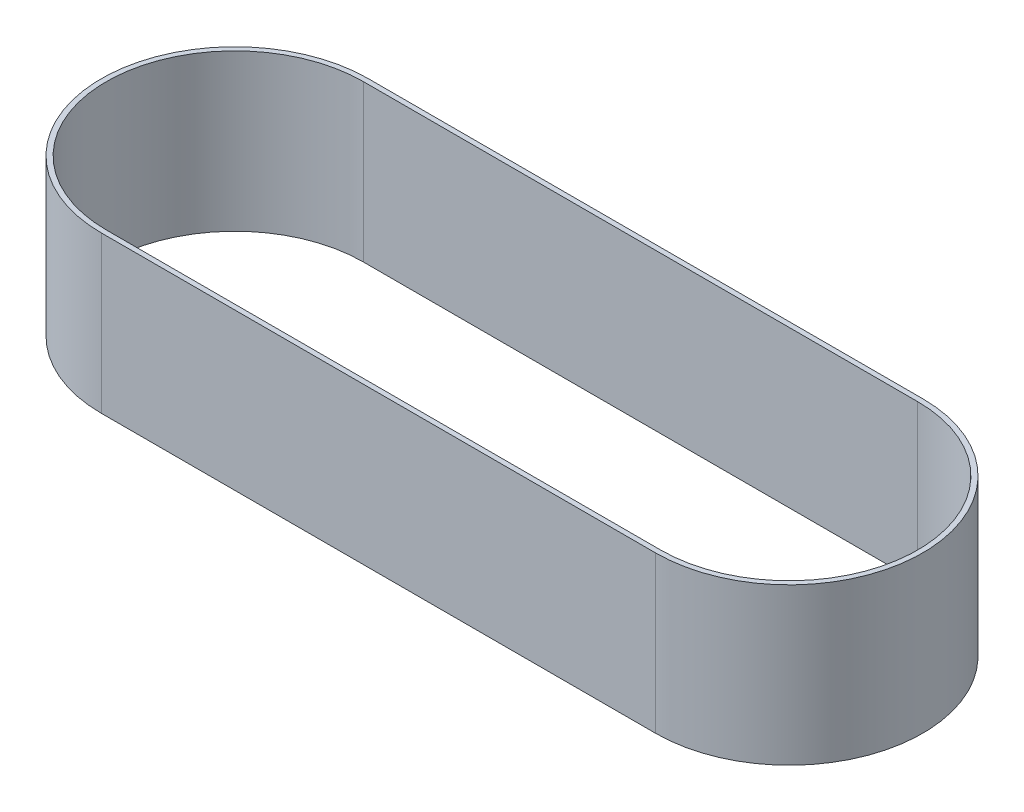
ISO-10303-21;
HEADER;
FILE_DESCRIPTION(('STEP AP214'),'2;1');
FILE_NAME('part.step','',(''),(''),'','','');
FILE_SCHEMA(('AUTOMOTIVE_DESIGN { 1 0 10303 214 1 1 1 1 }'));
ENDSEC;
DATA;
#1=APPLICATION_CONTEXT('core data for automotive mechanical design processes');
#2=APPLICATION_PROTOCOL_DEFINITION('international standard','automotive_design',2000,#1);
#3=PRODUCT_CONTEXT('',#1,'mechanical');
#4=PRODUCT('Part','Part','',(#3));
#5=PRODUCT_RELATED_PRODUCT_CATEGORY('part','',(#4));
#6=PRODUCT_DEFINITION_FORMATION('','',#4);
#7=PRODUCT_DEFINITION_CONTEXT('part definition',#1,'design');
#8=PRODUCT_DEFINITION('design','',#6,#7);
#9=PRODUCT_DEFINITION_SHAPE('','',#8);
#10=(LENGTH_UNIT() NAMED_UNIT(*) SI_UNIT(.MILLI.,.METRE.));
#11=(NAMED_UNIT(*) PLANE_ANGLE_UNIT() SI_UNIT($,.RADIAN.));
#12=(NAMED_UNIT(*) SI_UNIT($,.STERADIAN.) SOLID_ANGLE_UNIT());
#13=UNCERTAINTY_MEASURE_WITH_UNIT(LENGTH_MEASURE(1.E-05),#10,'distance_accuracy_value','');
#14=(GEOMETRIC_REPRESENTATION_CONTEXT(3) GLOBAL_UNCERTAINTY_ASSIGNED_CONTEXT((#13)) GLOBAL_UNIT_ASSIGNED_CONTEXT((#10,
#11,#12)) REPRESENTATION_CONTEXT('',''));
#15=CARTESIAN_POINT('',(0.,0.,0.));
#16=DIRECTION('',(0.,0.,1.));
#17=DIRECTION('',(1.,0.,0.));
#18=AXIS2_PLACEMENT_3D('',#15,#16,#17);
#19=CARTESIAN_POINT('',(0.,62.,53.));
#20=DIRECTION('',(0.,0.,-1.));
#21=DIRECTION('',(-1.,0.,0.));
#22=AXIS2_PLACEMENT_3D('',#19,#20,#21);
#23=PLANE('',#22);
#24=DIRECTION('',(1.,0.,0.));
#25=VECTOR('',#24,1.);
#26=CARTESIAN_POINT('',(0.,0.,53.));
#27=LINE('',#26,#25);
#28=CARTESIAN_POINT('',(-110.,0.,53.));
#29=VERTEX_POINT('',#28);
#30=CARTESIAN_POINT('',(110.,0.,53.));
#31=VERTEX_POINT('',#30);
#32=EDGE_CURVE('E141',#29,#31,#27,.T.);
#33=ORIENTED_EDGE('',*,*,#32,.T.);
#34=DIRECTION('',(0.,-1.,0.));
#35=VECTOR('',#34,1.);
#36=CARTESIAN_POINT('',(110.,62.,53.));
#37=LINE('',#36,#35);
#38=CARTESIAN_POINT('',(110.,62.,53.));
#39=VERTEX_POINT('',#38);
#40=EDGE_CURVE('E11',#39,#31,#37,.T.);
#41=ORIENTED_EDGE('',*,*,#40,.F.);
#42=DIRECTION('',(1.,0.,0.));
#43=VECTOR('',#42,1.);
#44=CARTESIAN_POINT('',(0.,62.,53.));
#45=LINE('',#44,#43);
#46=CARTESIAN_POINT('',(-110.,62.,53.));
#47=VERTEX_POINT('',#46);
#48=EDGE_CURVE('E112',#47,#39,#45,.T.);
#49=ORIENTED_EDGE('',*,*,#48,.F.);
#50=DIRECTION('',(0.,-1.,0.));
#51=VECTOR('',#50,1.);
#52=CARTESIAN_POINT('',(-110.,62.,53.));
#53=LINE('',#52,#51);
#54=EDGE_CURVE('E149',#47,#29,#53,.T.);
#55=ORIENTED_EDGE('',*,*,#54,.T.);
#56=EDGE_LOOP('',(#33,#41,#49,#55));
#57=FACE_BOUND('',#56,.T.);
#58=ADVANCED_FACE('F35',(#57),#23,.F.);
#59=CARTESIAN_POINT('',(110.,62.,0.));
#60=DIRECTION('',(0.,-1.,0.));
#61=DIRECTION('',(0.,0.,-1.));
#62=AXIS2_PLACEMENT_3D('',#59,#60,#61);
#63=CYLINDRICAL_SURFACE('',#62,53.);
#64=CARTESIAN_POINT('',(110.,0.,0.));
#65=DIRECTION('',(0.,1.,0.));
#66=DIRECTION('',(0.,0.,1.));
#67=AXIS2_PLACEMENT_3D('',#64,#65,#66);
#68=CIRCLE('',#67,53.);
#69=CARTESIAN_POINT('',(110.,0.,-53.));
#70=VERTEX_POINT('',#69);
#71=EDGE_CURVE('E118',#31,#70,#68,.T.);
#72=ORIENTED_EDGE('',*,*,#71,.T.);
#73=DIRECTION('',(0.,-1.,0.));
#74=VECTOR('',#73,1.);
#75=CARTESIAN_POINT('',(110.,62.,-53.));
#76=LINE('',#75,#74);
#77=CARTESIAN_POINT('',(110.,62.,-53.));
#78=VERTEX_POINT('',#77);
#79=EDGE_CURVE('E45',#78,#70,#76,.T.);
#80=ORIENTED_EDGE('',*,*,#79,.F.);
#81=CARTESIAN_POINT('',(110.,62.,0.));
#82=DIRECTION('',(0.,1.,0.));
#83=DIRECTION('',(0.,0.,1.));
#84=AXIS2_PLACEMENT_3D('',#81,#82,#83);
#85=CIRCLE('',#84,53.);
#86=EDGE_CURVE('E106',#39,#78,#85,.T.);
#87=ORIENTED_EDGE('',*,*,#86,.F.);
#88=ORIENTED_EDGE('',*,*,#40,.T.);
#89=EDGE_LOOP('',(#72,#80,#87,#88));
#90=FACE_BOUND('',#89,.T.);
#91=ADVANCED_FACE('F117',(#90),#63,.T.);
#92=CARTESIAN_POINT('',(0.,62.,-53.));
#93=DIRECTION('',(0.,0.,-1.));
#94=DIRECTION('',(-1.,0.,0.));
#95=AXIS2_PLACEMENT_3D('',#92,#93,#94);
#96=PLANE('',#95);
#97=DIRECTION('',(1.,0.,0.));
#98=VECTOR('',#97,1.);
#99=CARTESIAN_POINT('',(0.,0.,-53.));
#100=LINE('',#99,#98);
#101=CARTESIAN_POINT('',(-110.,0.,-53.));
#102=VERTEX_POINT('',#101);
#103=EDGE_CURVE('E145',#102,#70,#100,.T.);
#104=ORIENTED_EDGE('',*,*,#103,.F.);
#105=DIRECTION('',(0.,-1.,0.));
#106=VECTOR('',#105,1.);
#107=CARTESIAN_POINT('',(-110.,62.,-53.));
#108=LINE('',#107,#106);
#109=CARTESIAN_POINT('',(-110.,62.,-53.));
#110=VERTEX_POINT('',#109);
#111=EDGE_CURVE('E82',#110,#102,#108,.T.);
#112=ORIENTED_EDGE('',*,*,#111,.F.);
#113=DIRECTION('',(1.,0.,0.));
#114=VECTOR('',#113,1.);
#115=CARTESIAN_POINT('',(0.,62.,-53.));
#116=LINE('',#115,#114);
#117=EDGE_CURVE('E110',#110,#78,#116,.T.);
#118=ORIENTED_EDGE('',*,*,#117,.T.);
#119=ORIENTED_EDGE('',*,*,#79,.T.);
#120=EDGE_LOOP('',(#104,#112,#118,#119));
#121=FACE_BOUND('',#120,.T.);
#122=ADVANCED_FACE('F123',(#121),#96,.T.);
#123=CARTESIAN_POINT('',(-110.,62.,0.));
#124=DIRECTION('',(0.,-1.,0.));
#125=DIRECTION('',(0.,0.,-1.));
#126=AXIS2_PLACEMENT_3D('',#123,#124,#125);
#127=CYLINDRICAL_SURFACE('',#126,51.);
#128=CARTESIAN_POINT('',(-110.,0.,0.));
#129=DIRECTION('',(0.,1.,0.));
#130=DIRECTION('',(0.,0.,1.));
#131=AXIS2_PLACEMENT_3D('',#128,#129,#130);
#132=CIRCLE('',#131,51.);
#133=CARTESIAN_POINT('',(-110.,0.,-51.));
#134=VERTEX_POINT('',#133);
#135=CARTESIAN_POINT('',(-110.,0.,51.));
#136=VERTEX_POINT('',#135);
#137=EDGE_CURVE('E129',#134,#136,#132,.T.);
#138=ORIENTED_EDGE('',*,*,#137,.F.);
#139=DIRECTION('',(0.,-1.,0.));
#140=VECTOR('',#139,1.);
#141=CARTESIAN_POINT('',(-110.,62.,-51.));
#142=LINE('',#141,#140);
#143=CARTESIAN_POINT('',(-110.,62.,-51.));
#144=VERTEX_POINT('',#143);
#145=EDGE_CURVE('E39',#144,#134,#142,.T.);
#146=ORIENTED_EDGE('',*,*,#145,.F.);
#147=CARTESIAN_POINT('',(-110.,62.,0.));
#148=DIRECTION('',(0.,1.,0.));
#149=DIRECTION('',(0.,0.,1.));
#150=AXIS2_PLACEMENT_3D('',#147,#148,#149);
#151=CIRCLE('',#150,51.);
#152=CARTESIAN_POINT('',(-110.,62.,51.));
#153=VERTEX_POINT('',#152);
#154=EDGE_CURVE('E148',#144,#153,#151,.T.);
#155=ORIENTED_EDGE('',*,*,#154,.T.);
#156=DIRECTION('',(0.,-1.,0.));
#157=VECTOR('',#156,1.);
#158=CARTESIAN_POINT('',(-110.,62.,51.));
#159=LINE('',#158,#157);
#160=EDGE_CURVE('E125',#153,#136,#159,.T.);
#161=ORIENTED_EDGE('',*,*,#160,.T.);
#162=EDGE_LOOP('',(#138,#146,#155,#161));
#163=FACE_BOUND('',#162,.T.);
#164=ADVANCED_FACE('F37',(#163),#127,.F.);
#165=CARTESIAN_POINT('',(0.,62.,-51.));
#166=DIRECTION('',(0.,0.,-1.));
#167=DIRECTION('',(-1.,0.,0.));
#168=AXIS2_PLACEMENT_3D('',#165,#166,#167);
#169=PLANE('',#168);
#170=DIRECTION('',(1.,0.,0.));
#171=VECTOR('',#170,1.);
#172=CARTESIAN_POINT('',(0.,0.,-51.));
#173=LINE('',#172,#171);
#174=CARTESIAN_POINT('',(110.,0.,-51.));
#175=VERTEX_POINT('',#174);
#176=EDGE_CURVE('E132',#134,#175,#173,.T.);
#177=ORIENTED_EDGE('',*,*,#176,.T.);
#178=DIRECTION('',(0.,-1.,0.));
#179=VECTOR('',#178,1.);
#180=CARTESIAN_POINT('',(110.,62.,-51.));
#181=LINE('',#180,#179);
#182=CARTESIAN_POINT('',(110.,62.,-51.));
#183=VERTEX_POINT('',#182);
#184=EDGE_CURVE('E154',#183,#175,#181,.T.);
#185=ORIENTED_EDGE('',*,*,#184,.F.);
#186=DIRECTION('',(1.,0.,0.));
#187=VECTOR('',#186,1.);
#188=CARTESIAN_POINT('',(0.,62.,-51.));
#189=LINE('',#188,#187);
#190=EDGE_CURVE('E162',#144,#183,#189,.T.);
#191=ORIENTED_EDGE('',*,*,#190,.F.);
#192=ORIENTED_EDGE('',*,*,#145,.T.);
#193=EDGE_LOOP('',(#177,#185,#191,#192));
#194=FACE_BOUND('',#193,.T.);
#195=ADVANCED_FACE('F161',(#194),#169,.F.);
#196=CARTESIAN_POINT('',(110.,62.,0.));
#197=DIRECTION('',(0.,-1.,0.));
#198=DIRECTION('',(0.,0.,-1.));
#199=AXIS2_PLACEMENT_3D('',#196,#197,#198);
#200=CYLINDRICAL_SURFACE('',#199,51.);
#201=CARTESIAN_POINT('',(110.,0.,0.));
#202=DIRECTION('',(0.,1.,0.));
#203=DIRECTION('',(0.,0.,1.));
#204=AXIS2_PLACEMENT_3D('',#201,#202,#203);
#205=CIRCLE('',#204,51.);
#206=CARTESIAN_POINT('',(110.,0.,51.));
#207=VERTEX_POINT('',#206);
#208=EDGE_CURVE('E135',#207,#175,#205,.T.);
#209=ORIENTED_EDGE('',*,*,#208,.F.);
#210=DIRECTION('',(0.,-1.,0.));
#211=VECTOR('',#210,1.);
#212=CARTESIAN_POINT('',(110.,62.,51.));
#213=LINE('',#212,#211);
#214=CARTESIAN_POINT('',(110.,62.,51.));
#215=VERTEX_POINT('',#214);
#216=EDGE_CURVE('E153',#215,#207,#213,.T.);
#217=ORIENTED_EDGE('',*,*,#216,.F.);
#218=CARTESIAN_POINT('',(110.,62.,0.));
#219=DIRECTION('',(0.,1.,0.));
#220=DIRECTION('',(0.,0.,1.));
#221=AXIS2_PLACEMENT_3D('',#218,#219,#220);
#222=CIRCLE('',#221,51.);
#223=EDGE_CURVE('E202',#215,#183,#222,.T.);
#224=ORIENTED_EDGE('',*,*,#223,.T.);
#225=ORIENTED_EDGE('',*,*,#184,.T.);
#226=EDGE_LOOP('',(#209,#217,#224,#225));
#227=FACE_BOUND('',#226,.T.);
#228=ADVANCED_FACE('F174',(#227),#200,.F.);
#229=CARTESIAN_POINT('',(0.,62.,51.));
#230=DIRECTION('',(0.,0.,-1.));
#231=DIRECTION('',(-1.,0.,0.));
#232=AXIS2_PLACEMENT_3D('',#229,#230,#231);
#233=PLANE('',#232);
#234=DIRECTION('',(1.,0.,0.));
#235=VECTOR('',#234,1.);
#236=CARTESIAN_POINT('',(0.,0.,51.));
#237=LINE('',#236,#235);
#238=EDGE_CURVE('E138',#136,#207,#237,.T.);
#239=ORIENTED_EDGE('',*,*,#238,.F.);
#240=ORIENTED_EDGE('',*,*,#160,.F.);
#241=DIRECTION('',(1.,0.,0.));
#242=VECTOR('',#241,1.);
#243=CARTESIAN_POINT('',(0.,62.,51.));
#244=LINE('',#243,#242);
#245=EDGE_CURVE('E172',#153,#215,#244,.T.);
#246=ORIENTED_EDGE('',*,*,#245,.T.);
#247=ORIENTED_EDGE('',*,*,#216,.T.);
#248=EDGE_LOOP('',(#239,#240,#246,#247));
#249=FACE_BOUND('',#248,.T.);
#250=ADVANCED_FACE('F171',(#249),#233,.T.);
#251=CARTESIAN_POINT('',(-110.,62.,0.));
#252=DIRECTION('',(0.,-1.,0.));
#253=DIRECTION('',(0.,0.,-1.));
#254=AXIS2_PLACEMENT_3D('',#251,#252,#253);
#255=CYLINDRICAL_SURFACE('',#254,53.);
#256=CARTESIAN_POINT('',(-110.,0.,0.));
#257=DIRECTION('',(0.,1.,0.));
#258=DIRECTION('',(0.,0.,1.));
#259=AXIS2_PLACEMENT_3D('',#256,#257,#258);
#260=CIRCLE('',#259,53.);
#261=EDGE_CURVE('E85',#102,#29,#260,.T.);
#262=ORIENTED_EDGE('',*,*,#261,.T.);
#263=ORIENTED_EDGE('',*,*,#54,.F.);
#264=CARTESIAN_POINT('',(-110.,62.,0.));
#265=DIRECTION('',(0.,1.,0.));
#266=DIRECTION('',(0.,0.,1.));
#267=AXIS2_PLACEMENT_3D('',#264,#265,#266);
#268=CIRCLE('',#267,53.);
#269=EDGE_CURVE('E54',#110,#47,#268,.T.);
#270=ORIENTED_EDGE('',*,*,#269,.F.);
#271=ORIENTED_EDGE('',*,*,#111,.T.);
#272=EDGE_LOOP('',(#262,#263,#270,#271));
#273=FACE_BOUND('',#272,.T.);
#274=ADVANCED_FACE('F181',(#273),#255,.T.);
#275=CARTESIAN_POINT('',(0.,62.,0.));
#276=DIRECTION('',(0.,1.,0.));
#277=DIRECTION('',(0.,0.,1.));
#278=AXIS2_PLACEMENT_3D('',#275,#276,#277);
#279=PLANE('',#278);
#280=ORIENTED_EDGE('',*,*,#154,.F.);
#281=ORIENTED_EDGE('',*,*,#190,.T.);
#282=ORIENTED_EDGE('',*,*,#223,.F.);
#283=ORIENTED_EDGE('',*,*,#245,.F.);
#284=EDGE_LOOP('',(#280,#281,#282,#283));
#285=FACE_BOUND('',#284,.T.);
#286=ORIENTED_EDGE('',*,*,#48,.T.);
#287=ORIENTED_EDGE('',*,*,#86,.T.);
#288=ORIENTED_EDGE('',*,*,#117,.F.);
#289=ORIENTED_EDGE('',*,*,#269,.T.);
#290=EDGE_LOOP('',(#286,#287,#288,#289));
#291=FACE_BOUND('',#290,.T.);
#292=ADVANCED_FACE('F108',(#285,#291),#279,.T.);
#293=CARTESIAN_POINT('',(0.,0.,0.));
#294=DIRECTION('',(0.,1.,0.));
#295=DIRECTION('',(0.,0.,1.));
#296=AXIS2_PLACEMENT_3D('',#293,#294,#295);
#297=PLANE('',#296);
#298=ORIENTED_EDGE('',*,*,#137,.T.);
#299=ORIENTED_EDGE('',*,*,#238,.T.);
#300=ORIENTED_EDGE('',*,*,#208,.T.);
#301=ORIENTED_EDGE('',*,*,#176,.F.);
#302=EDGE_LOOP('',(#298,#299,#300,#301));
#303=FACE_BOUND('',#302,.T.);
#304=ORIENTED_EDGE('',*,*,#32,.F.);
#305=ORIENTED_EDGE('',*,*,#261,.F.);
#306=ORIENTED_EDGE('',*,*,#103,.T.);
#307=ORIENTED_EDGE('',*,*,#71,.F.);
#308=EDGE_LOOP('',(#304,#305,#306,#307));
#309=FACE_BOUND('',#308,.T.);
#310=ADVANCED_FACE('F165',(#303,#309),#297,.F.);
#311=CLOSED_SHELL('',(#58,#91,#122,#164,#195,#228,#250,#274,#292,#310));
#312=MANIFOLD_SOLID_BREP('B2',#311);
#313=ADVANCED_BREP_SHAPE_REPRESENTATION('',(#18,#312),#14);
#314=SHAPE_DEFINITION_REPRESENTATION(#9,#313);
ENDSEC;
END-ISO-10303-21;
